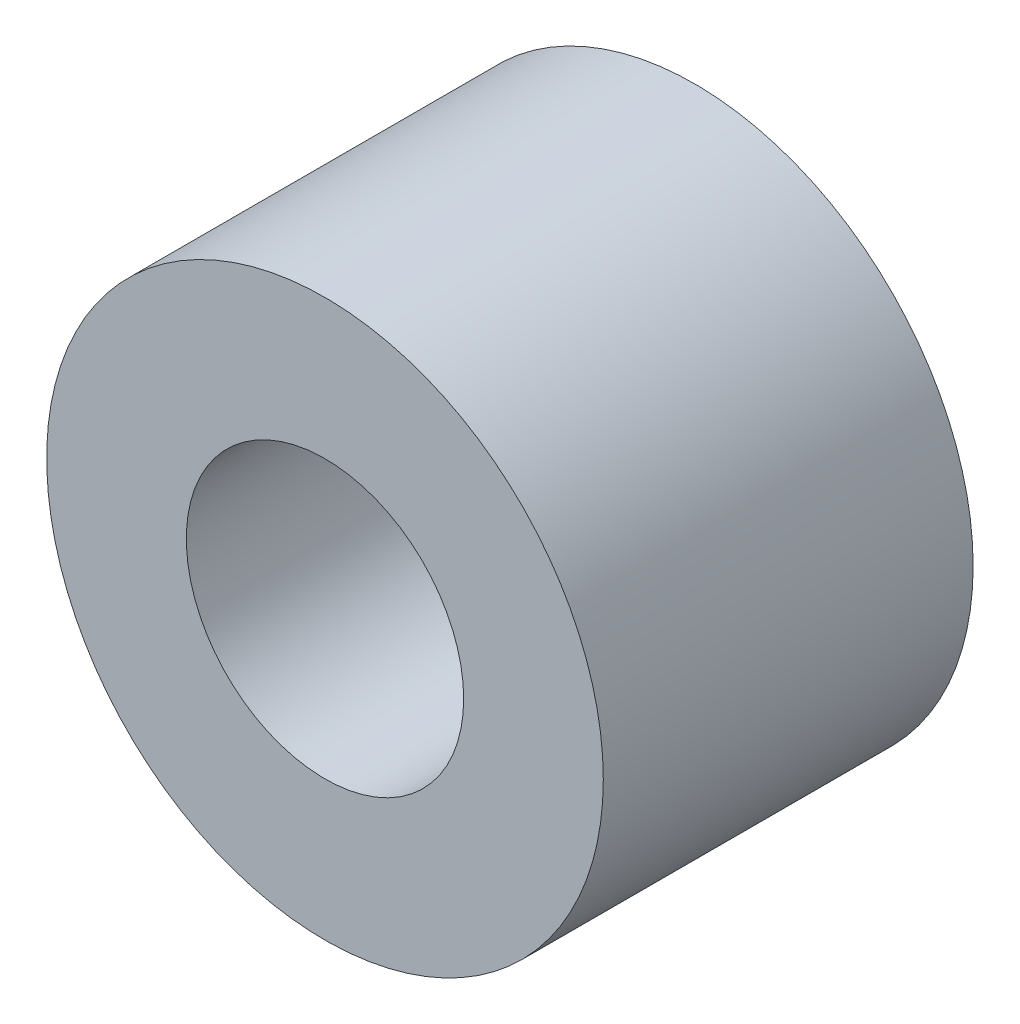
ISO-10303-21;
HEADER;
FILE_DESCRIPTION(('STEP AP214'),'2;1');
FILE_NAME('part.step','',(''),(''),'','','');
FILE_SCHEMA(('AUTOMOTIVE_DESIGN { 1 0 10303 214 1 1 1 1 }'));
ENDSEC;
DATA;
#1=APPLICATION_CONTEXT('core data for automotive mechanical design processes');
#2=APPLICATION_PROTOCOL_DEFINITION('international standard','automotive_design',2000,#1);
#3=PRODUCT_CONTEXT('',#1,'mechanical');
#4=PRODUCT('Part','Part','',(#3));
#5=PRODUCT_RELATED_PRODUCT_CATEGORY('part','',(#4));
#6=PRODUCT_DEFINITION_FORMATION('','',#4);
#7=PRODUCT_DEFINITION_CONTEXT('part definition',#1,'design');
#8=PRODUCT_DEFINITION('design','',#6,#7);
#9=PRODUCT_DEFINITION_SHAPE('','',#8);
#10=(LENGTH_UNIT() NAMED_UNIT(*) SI_UNIT(.MILLI.,.METRE.));
#11=(NAMED_UNIT(*) PLANE_ANGLE_UNIT() SI_UNIT($,.RADIAN.));
#12=(NAMED_UNIT(*) SI_UNIT($,.STERADIAN.) SOLID_ANGLE_UNIT());
#13=UNCERTAINTY_MEASURE_WITH_UNIT(LENGTH_MEASURE(1.E-05),#10,'distance_accuracy_value','');
#14=(GEOMETRIC_REPRESENTATION_CONTEXT(3) GLOBAL_UNCERTAINTY_ASSIGNED_CONTEXT((#13)) GLOBAL_UNIT_ASSIGNED_CONTEXT((#10,
#11,#12)) REPRESENTATION_CONTEXT('',''));
#15=CARTESIAN_POINT('',(0.,0.,0.));
#16=DIRECTION('',(0.,0.,1.));
#17=DIRECTION('',(1.,0.,0.));
#18=AXIS2_PLACEMENT_3D('',#15,#16,#17);
#19=CARTESIAN_POINT('',(0.,0.,2.));
#20=DIRECTION('',(0.,0.,1.));
#21=DIRECTION('',(1.,0.,0.));
#22=AXIS2_PLACEMENT_3D('',#19,#20,#21);
#23=PLANE('',#22);
#24=CARTESIAN_POINT('',(0.,0.,2.));
#25=DIRECTION('',(0.,0.,1.));
#26=DIRECTION('',(1.,0.,0.));
#27=AXIS2_PLACEMENT_3D('',#24,#25,#26);
#28=CIRCLE('',#27,3.01);
#29=CARTESIAN_POINT('',(3.01,0.,2.));
#30=VERTEX_POINT('',#29);
#31=EDGE_CURVE('E10',#30,#30,#28,.T.);
#32=ORIENTED_EDGE('',*,*,#31,.T.);
#33=EDGE_LOOP('',(#32));
#34=FACE_BOUND('',#33,.T.);
#35=CARTESIAN_POINT('',(0.,0.,2.));
#36=DIRECTION('',(0.,0.,1.));
#37=DIRECTION('',(1.,0.,0.));
#38=AXIS2_PLACEMENT_3D('',#35,#36,#37);
#39=CIRCLE('',#38,1.5);
#40=CARTESIAN_POINT('',(1.5,0.,2.));
#41=VERTEX_POINT('',#40);
#42=EDGE_CURVE('E41',#41,#41,#39,.T.);
#43=ORIENTED_EDGE('',*,*,#42,.F.);
#44=EDGE_LOOP('',(#43));
#45=FACE_BOUND('',#44,.T.);
#46=ADVANCED_FACE('F30',(#34,#45),#23,.T.);
#47=CARTESIAN_POINT('',(0.,0.,-2.));
#48=DIRECTION('',(0.,0.,1.));
#49=DIRECTION('',(1.,0.,0.));
#50=AXIS2_PLACEMENT_3D('',#47,#48,#49);
#51=PLANE('',#50);
#52=CARTESIAN_POINT('',(0.,0.,-2.));
#53=DIRECTION('',(0.,0.,1.));
#54=DIRECTION('',(1.,0.,0.));
#55=AXIS2_PLACEMENT_3D('',#52,#53,#54);
#56=CIRCLE('',#55,3.01);
#57=CARTESIAN_POINT('',(3.01,0.,-2.));
#58=VERTEX_POINT('',#57);
#59=EDGE_CURVE('E34',#58,#58,#56,.T.);
#60=ORIENTED_EDGE('',*,*,#59,.F.);
#61=EDGE_LOOP('',(#60));
#62=FACE_BOUND('',#61,.T.);
#63=CARTESIAN_POINT('',(0.,0.,-2.));
#64=DIRECTION('',(0.,0.,1.));
#65=DIRECTION('',(1.,0.,0.));
#66=AXIS2_PLACEMENT_3D('',#63,#64,#65);
#67=CIRCLE('',#66,1.5);
#68=CARTESIAN_POINT('',(1.5,0.,-2.));
#69=VERTEX_POINT('',#68);
#70=EDGE_CURVE('E43',#69,#69,#67,.T.);
#71=ORIENTED_EDGE('',*,*,#70,.T.);
#72=EDGE_LOOP('',(#71));
#73=FACE_BOUND('',#72,.T.);
#74=ADVANCED_FACE('F53',(#62,#73),#51,.F.);
#75=CARTESIAN_POINT('',(0.,0.,2.));
#76=DIRECTION('',(0.,0.,-1.));
#77=DIRECTION('',(-1.,0.,0.));
#78=AXIS2_PLACEMENT_3D('',#75,#76,#77);
#79=CYLINDRICAL_SURFACE('',#78,3.01);
#80=ORIENTED_EDGE('',*,*,#31,.F.);
#81=EDGE_LOOP('',(#80));
#82=FACE_BOUND('',#81,.T.);
#83=ORIENTED_EDGE('',*,*,#59,.T.);
#84=EDGE_LOOP('',(#83));
#85=FACE_BOUND('',#84,.T.);
#86=ADVANCED_FACE('F32',(#82,#85),#79,.T.);
#87=CARTESIAN_POINT('',(0.,0.,2.));
#88=DIRECTION('',(0.,0.,-1.));
#89=DIRECTION('',(-1.,0.,0.));
#90=AXIS2_PLACEMENT_3D('',#87,#88,#89);
#91=CYLINDRICAL_SURFACE('',#90,1.5);
#92=ORIENTED_EDGE('',*,*,#42,.T.);
#93=EDGE_LOOP('',(#92));
#94=FACE_BOUND('',#93,.T.);
#95=ORIENTED_EDGE('',*,*,#70,.F.);
#96=EDGE_LOOP('',(#95));
#97=FACE_BOUND('',#96,.T.);
#98=ADVANCED_FACE('F49',(#94,#97),#91,.F.);
#99=CLOSED_SHELL('',(#46,#74,#86,#98));
#100=MANIFOLD_SOLID_BREP('B2',#99);
#101=ADVANCED_BREP_SHAPE_REPRESENTATION('',(#18,#100),#14);
#102=SHAPE_DEFINITION_REPRESENTATION(#9,#101);
ENDSEC;
END-ISO-10303-21;
